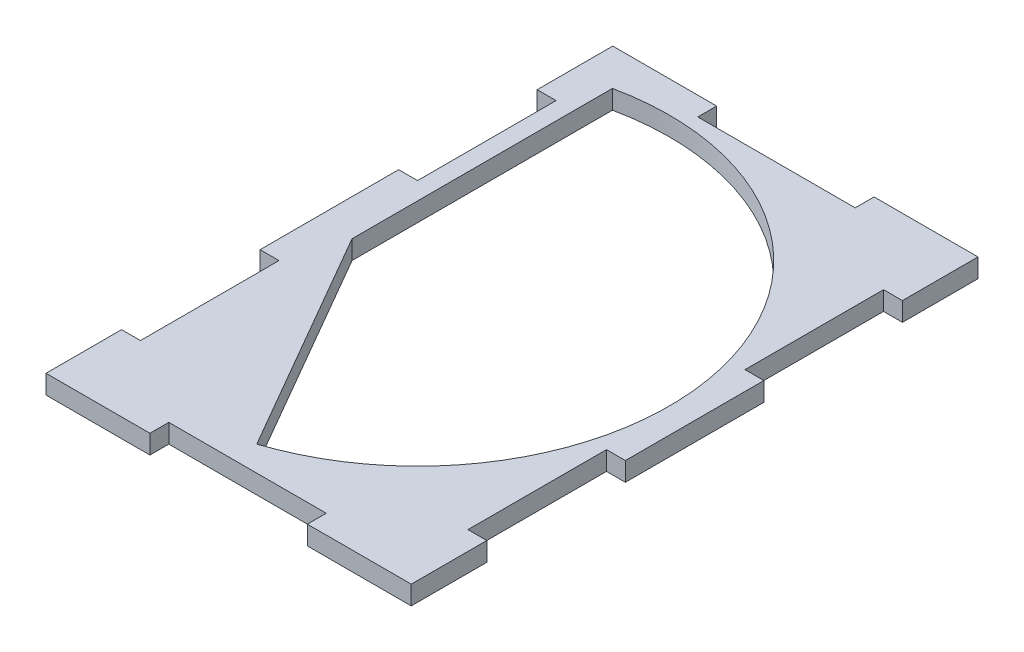
ISO-10303-21;
HEADER;
FILE_DESCRIPTION(('STEP AP214'),'2;1');
FILE_NAME('part.step','',(''),(''),'','','');
FILE_SCHEMA(('AUTOMOTIVE_DESIGN { 1 0 10303 214 1 1 1 1 }'));
ENDSEC;
DATA;
#1=APPLICATION_CONTEXT('core data for automotive mechanical design processes');
#2=APPLICATION_PROTOCOL_DEFINITION('international standard','automotive_design',2000,#1);
#3=PRODUCT_CONTEXT('',#1,'mechanical');
#4=PRODUCT('Part','Part','',(#3));
#5=PRODUCT_RELATED_PRODUCT_CATEGORY('part','',(#4));
#6=PRODUCT_DEFINITION_FORMATION('','',#4);
#7=PRODUCT_DEFINITION_CONTEXT('part definition',#1,'design');
#8=PRODUCT_DEFINITION('design','',#6,#7);
#9=PRODUCT_DEFINITION_SHAPE('','',#8);
#10=(LENGTH_UNIT() NAMED_UNIT(*) SI_UNIT(.MILLI.,.METRE.));
#11=(NAMED_UNIT(*) PLANE_ANGLE_UNIT() SI_UNIT($,.RADIAN.));
#12=(NAMED_UNIT(*) SI_UNIT($,.STERADIAN.) SOLID_ANGLE_UNIT());
#13=UNCERTAINTY_MEASURE_WITH_UNIT(LENGTH_MEASURE(1.E-05),#10,'distance_accuracy_value','');
#14=(GEOMETRIC_REPRESENTATION_CONTEXT(3) GLOBAL_UNCERTAINTY_ASSIGNED_CONTEXT((#13)) GLOBAL_UNIT_ASSIGNED_CONTEXT((#10,
#11,#12)) REPRESENTATION_CONTEXT('',''));
#15=CARTESIAN_POINT('',(0.,0.,0.));
#16=DIRECTION('',(0.,0.,1.));
#17=DIRECTION('',(1.,0.,0.));
#18=AXIS2_PLACEMENT_3D('',#15,#16,#17);
#19=CARTESIAN_POINT('',(0.,3.,0.));
#20=DIRECTION('',(0.,-1.,0.));
#21=DIRECTION('',(0.,0.,-1.));
#22=AXIS2_PLACEMENT_3D('',#19,#20,#21);
#23=PLANE('',#22);
#24=DIRECTION('',(1.,0.,0.));
#25=VECTOR('',#24,1.);
#26=CARTESIAN_POINT('',(-26.,3.,12.));
#27=LINE('',#26,#25);
#28=CARTESIAN_POINT('',(-26.,3.,12.));
#29=VERTEX_POINT('',#28);
#30=CARTESIAN_POINT('',(-23.,3.,12.));
#31=VERTEX_POINT('',#30);
#32=EDGE_CURVE('E263',#29,#31,#27,.T.);
#33=ORIENTED_EDGE('',*,*,#32,.T.);
#34=DIRECTION('',(0.,0.,1.));
#35=VECTOR('',#34,1.);
#36=CARTESIAN_POINT('',(-23.,3.,12.));
#37=LINE('',#36,#35);
#38=CARTESIAN_POINT('',(-23.,3.,34.));
#39=VERTEX_POINT('',#38);
#40=EDGE_CURVE('E266',#31,#39,#37,.T.);
#41=ORIENTED_EDGE('',*,*,#40,.T.);
#42=DIRECTION('',(-1.,0.,0.));
#43=VECTOR('',#42,1.);
#44=CARTESIAN_POINT('',(-23.,3.,34.));
#45=LINE('',#44,#43);
#46=CARTESIAN_POINT('',(-26.,3.,34.));
#47=VERTEX_POINT('',#46);
#48=EDGE_CURVE('E269',#39,#47,#45,.T.);
#49=ORIENTED_EDGE('',*,*,#48,.T.);
#50=DIRECTION('',(0.,0.,1.));
#51=VECTOR('',#50,1.);
#52=CARTESIAN_POINT('',(-26.,3.,34.));
#53=LINE('',#52,#51);
#54=CARTESIAN_POINT('',(-26.,3.,56.));
#55=VERTEX_POINT('',#54);
#56=EDGE_CURVE('E271',#47,#55,#53,.T.);
#57=ORIENTED_EDGE('',*,*,#56,.T.);
#58=DIRECTION('',(1.,0.,0.));
#59=VECTOR('',#58,1.);
#60=CARTESIAN_POINT('',(-26.,3.,56.));
#61=LINE('',#60,#59);
#62=CARTESIAN_POINT('',(-23.,3.,56.));
#63=VERTEX_POINT('',#62);
#64=EDGE_CURVE('E273',#55,#63,#61,.T.);
#65=ORIENTED_EDGE('',*,*,#64,.T.);
#66=DIRECTION('',(0.,0.,1.));
#67=VECTOR('',#66,1.);
#68=CARTESIAN_POINT('',(-23.,3.,56.));
#69=LINE('',#68,#67);
#70=CARTESIAN_POINT('',(-23.,3.,78.));
#71=VERTEX_POINT('',#70);
#72=EDGE_CURVE('E275',#63,#71,#69,.T.);
#73=ORIENTED_EDGE('',*,*,#72,.T.);
#74=DIRECTION('',(-1.,0.,0.));
#75=VECTOR('',#74,1.);
#76=CARTESIAN_POINT('',(-23.,3.,78.));
#77=LINE('',#76,#75);
#78=CARTESIAN_POINT('',(-26.,3.,78.));
#79=VERTEX_POINT('',#78);
#80=EDGE_CURVE('E277',#71,#79,#77,.T.);
#81=ORIENTED_EDGE('',*,*,#80,.T.);
#82=DIRECTION('',(0.,0.,1.));
#83=VECTOR('',#82,1.);
#84=CARTESIAN_POINT('',(-26.,3.,78.));
#85=LINE('',#84,#83);
#86=CARTESIAN_POINT('',(-26.,3.,90.));
#87=VERTEX_POINT('',#86);
#88=EDGE_CURVE('E279',#79,#87,#85,.T.);
#89=ORIENTED_EDGE('',*,*,#88,.T.);
#90=DIRECTION('',(1.,0.,0.));
#91=VECTOR('',#90,1.);
#92=CARTESIAN_POINT('',(-26.,3.,90.));
#93=LINE('',#92,#91);
#94=CARTESIAN_POINT('',(-9.49999999999999,3.,90.));
#95=VERTEX_POINT('',#94);
#96=EDGE_CURVE('E281',#87,#95,#93,.T.);
#97=ORIENTED_EDGE('',*,*,#96,.T.);
#98=DIRECTION('',(0.,0.,-1.));
#99=VECTOR('',#98,1.);
#100=CARTESIAN_POINT('',(-9.49999999999999,3.,90.));
#101=LINE('',#100,#99);
#102=CARTESIAN_POINT('',(-9.49999999999999,3.,87.));
#103=VERTEX_POINT('',#102);
#104=EDGE_CURVE('E283',#95,#103,#101,.T.);
#105=ORIENTED_EDGE('',*,*,#104,.T.);
#106=DIRECTION('',(1.,0.,0.));
#107=VECTOR('',#106,1.);
#108=CARTESIAN_POINT('',(-9.49999999999999,3.,87.));
#109=LINE('',#108,#107);
#110=CARTESIAN_POINT('',(15.5,3.,87.));
#111=VERTEX_POINT('',#110);
#112=EDGE_CURVE('E285',#103,#111,#109,.T.);
#113=ORIENTED_EDGE('',*,*,#112,.T.);
#114=DIRECTION('',(0.,0.,1.));
#115=VECTOR('',#114,1.);
#116=CARTESIAN_POINT('',(15.5,3.,87.));
#117=LINE('',#116,#115);
#118=CARTESIAN_POINT('',(15.5,3.,90.));
#119=VERTEX_POINT('',#118);
#120=EDGE_CURVE('E287',#111,#119,#117,.T.);
#121=ORIENTED_EDGE('',*,*,#120,.T.);
#122=DIRECTION('',(1.,0.,0.));
#123=VECTOR('',#122,1.);
#124=CARTESIAN_POINT('',(15.5,3.,90.));
#125=LINE('',#124,#123);
#126=CARTESIAN_POINT('',(32.,3.,90.));
#127=VERTEX_POINT('',#126);
#128=EDGE_CURVE('E289',#119,#127,#125,.T.);
#129=ORIENTED_EDGE('',*,*,#128,.T.);
#130=DIRECTION('',(0.,0.,-1.));
#131=VECTOR('',#130,1.);
#132=CARTESIAN_POINT('',(32.,3.,78.));
#133=LINE('',#132,#131);
#134=CARTESIAN_POINT('',(32.,3.,78.));
#135=VERTEX_POINT('',#134);
#136=EDGE_CURVE('E291',#127,#135,#133,.T.);
#137=ORIENTED_EDGE('',*,*,#136,.T.);
#138=DIRECTION('',(-1.,0.,0.));
#139=VECTOR('',#138,1.);
#140=CARTESIAN_POINT('',(32.,3.,78.));
#141=LINE('',#140,#139);
#142=CARTESIAN_POINT('',(29.,3.,78.));
#143=VERTEX_POINT('',#142);
#144=EDGE_CURVE('E293',#135,#143,#141,.T.);
#145=ORIENTED_EDGE('',*,*,#144,.T.);
#146=DIRECTION('',(0.,0.,-1.));
#147=VECTOR('',#146,1.);
#148=CARTESIAN_POINT('',(29.,3.,78.));
#149=LINE('',#148,#147);
#150=CARTESIAN_POINT('',(29.,3.,56.));
#151=VERTEX_POINT('',#150);
#152=EDGE_CURVE('E295',#143,#151,#149,.T.);
#153=ORIENTED_EDGE('',*,*,#152,.T.);
#154=DIRECTION('',(1.,0.,0.));
#155=VECTOR('',#154,1.);
#156=CARTESIAN_POINT('',(29.,3.,56.));
#157=LINE('',#156,#155);
#158=CARTESIAN_POINT('',(32.,3.,56.));
#159=VERTEX_POINT('',#158);
#160=EDGE_CURVE('E297',#151,#159,#157,.T.);
#161=ORIENTED_EDGE('',*,*,#160,.T.);
#162=DIRECTION('',(0.,0.,-1.));
#163=VECTOR('',#162,1.);
#164=CARTESIAN_POINT('',(32.,3.,34.));
#165=LINE('',#164,#163);
#166=CARTESIAN_POINT('',(32.,3.,34.));
#167=VERTEX_POINT('',#166);
#168=EDGE_CURVE('E299',#159,#167,#165,.T.);
#169=ORIENTED_EDGE('',*,*,#168,.T.);
#170=DIRECTION('',(-1.,0.,0.));
#171=VECTOR('',#170,1.);
#172=CARTESIAN_POINT('',(29.,3.,34.));
#173=LINE('',#172,#171);
#174=CARTESIAN_POINT('',(29.,3.,34.));
#175=VERTEX_POINT('',#174);
#176=EDGE_CURVE('E301',#167,#175,#173,.T.);
#177=ORIENTED_EDGE('',*,*,#176,.T.);
#178=DIRECTION('',(0.,0.,-1.));
#179=VECTOR('',#178,1.);
#180=CARTESIAN_POINT('',(29.,3.,12.));
#181=LINE('',#180,#179);
#182=CARTESIAN_POINT('',(29.,3.,12.));
#183=VERTEX_POINT('',#182);
#184=EDGE_CURVE('E303',#175,#183,#181,.T.);
#185=ORIENTED_EDGE('',*,*,#184,.T.);
#186=DIRECTION('',(1.,0.,0.));
#187=VECTOR('',#186,1.);
#188=CARTESIAN_POINT('',(32.,3.,12.));
#189=LINE('',#188,#187);
#190=CARTESIAN_POINT('',(32.,3.,12.));
#191=VERTEX_POINT('',#190);
#192=EDGE_CURVE('E305',#183,#191,#189,.T.);
#193=ORIENTED_EDGE('',*,*,#192,.T.);
#194=DIRECTION('',(0.,0.,-1.));
#195=VECTOR('',#194,1.);
#196=CARTESIAN_POINT('',(32.,3.,0.));
#197=LINE('',#196,#195);
#198=CARTESIAN_POINT('',(32.,3.,0.));
#199=VERTEX_POINT('',#198);
#200=EDGE_CURVE('E307',#191,#199,#197,.T.);
#201=ORIENTED_EDGE('',*,*,#200,.T.);
#202=DIRECTION('',(-1.,0.,0.));
#203=VECTOR('',#202,1.);
#204=CARTESIAN_POINT('',(15.5,3.,0.));
#205=LINE('',#204,#203);
#206=CARTESIAN_POINT('',(15.5,3.,0.));
#207=VERTEX_POINT('',#206);
#208=EDGE_CURVE('E309',#199,#207,#205,.T.);
#209=ORIENTED_EDGE('',*,*,#208,.T.);
#210=DIRECTION('',(0.,0.,1.));
#211=VECTOR('',#210,1.);
#212=CARTESIAN_POINT('',(15.5,3.,3.));
#213=LINE('',#212,#211);
#214=CARTESIAN_POINT('',(15.5,3.,3.));
#215=VERTEX_POINT('',#214);
#216=EDGE_CURVE('E311',#207,#215,#213,.T.);
#217=ORIENTED_EDGE('',*,*,#216,.T.);
#218=DIRECTION('',(-1.,0.,0.));
#219=VECTOR('',#218,1.);
#220=CARTESIAN_POINT('',(-9.5,3.,3.));
#221=LINE('',#220,#219);
#222=CARTESIAN_POINT('',(-9.5,3.,3.));
#223=VERTEX_POINT('',#222);
#224=EDGE_CURVE('E313',#215,#223,#221,.T.);
#225=ORIENTED_EDGE('',*,*,#224,.T.);
#226=DIRECTION('',(0.,0.,-1.));
#227=VECTOR('',#226,1.);
#228=CARTESIAN_POINT('',(-9.5,3.,0.));
#229=LINE('',#228,#227);
#230=CARTESIAN_POINT('',(-9.5,3.,0.));
#231=VERTEX_POINT('',#230);
#232=EDGE_CURVE('E315',#223,#231,#229,.T.);
#233=ORIENTED_EDGE('',*,*,#232,.T.);
#234=DIRECTION('',(-1.,0.,0.));
#235=VECTOR('',#234,1.);
#236=CARTESIAN_POINT('',(-26.,3.,0.));
#237=LINE('',#236,#235);
#238=CARTESIAN_POINT('',(-26.,3.,0.));
#239=VERTEX_POINT('',#238);
#240=EDGE_CURVE('E317',#231,#239,#237,.T.);
#241=ORIENTED_EDGE('',*,*,#240,.T.);
#242=DIRECTION('',(0.,0.,1.));
#243=VECTOR('',#242,1.);
#244=CARTESIAN_POINT('',(-26.,3.,0.));
#245=LINE('',#244,#243);
#246=EDGE_CURVE('E319',#239,#29,#245,.T.);
#247=ORIENTED_EDGE('',*,*,#246,.T.);
#248=EDGE_LOOP('',(#33,#41,#49,#57,#65,#73,#81,#89,#97,#105,#113,#121,#129,#137,#145,#153,#161,
#169,#177,#185,#193,#201,#209,#217,#225,#233,#241,#247));
#249=FACE_BOUND('',#248,.T.);
#250=CARTESIAN_POINT('',(-12.,3.,45.));
#251=DIRECTION('',(0.,1.,0.));
#252=DIRECTION('',(0.,0.,-1.));
#253=AXIS2_PLACEMENT_3D('',#250,#251,#252);
#254=CIRCLE('',#253,40.);
#255=CARTESIAN_POINT('',(0.473831151104231,3.,83.0053093187483));
#256=VERTEX_POINT('',#255);
#257=CARTESIAN_POINT('',(-20.2,3.,5.84952107572628));
#258=VERTEX_POINT('',#257);
#259=EDGE_CURVE('E236',#256,#258,#254,.T.);
#260=ORIENTED_EDGE('',*,*,#259,.F.);
#261=DIRECTION('',(0.499999999999995,0.,0.866025403784442));
#262=VECTOR('',#261,1.);
#263=CARTESIAN_POINT('',(-20.2,3.,47.1971833779352));
#264=LINE('',#263,#262);
#265=CARTESIAN_POINT('',(-20.2,3.,47.1971833779352));
#266=VERTEX_POINT('',#265);
#267=EDGE_CURVE('E253',#266,#256,#264,.T.);
#268=ORIENTED_EDGE('',*,*,#267,.F.);
#269=DIRECTION('',(0.,0.,1.));
#270=VECTOR('',#269,1.);
#271=CARTESIAN_POINT('',(-20.2,3.,47.1971833779352));
#272=LINE('',#271,#270);
#273=EDGE_CURVE('E244',#258,#266,#272,.T.);
#274=ORIENTED_EDGE('',*,*,#273,.F.);
#275=EDGE_LOOP('',(#260,#268,#274));
#276=FACE_BOUND('',#275,.T.);
#277=ADVANCED_FACE('F33',(#249,#276),#23,.F.);
#278=CARTESIAN_POINT('',(0.,0.,0.));
#279=DIRECTION('',(0.,-1.,0.));
#280=DIRECTION('',(0.,0.,-1.));
#281=AXIS2_PLACEMENT_3D('',#278,#279,#280);
#282=PLANE('',#281);
#283=DIRECTION('',(1.,0.,0.));
#284=VECTOR('',#283,1.);
#285=CARTESIAN_POINT('',(-26.,0.,12.));
#286=LINE('',#285,#284);
#287=CARTESIAN_POINT('',(-26.,0.,12.));
#288=VERTEX_POINT('',#287);
#289=CARTESIAN_POINT('',(-23.,0.,12.));
#290=VERTEX_POINT('',#289);
#291=EDGE_CURVE('E251',#288,#290,#286,.T.);
#292=ORIENTED_EDGE('',*,*,#291,.F.);
#293=DIRECTION('',(0.,0.,1.));
#294=VECTOR('',#293,1.);
#295=CARTESIAN_POINT('',(-26.,0.,0.));
#296=LINE('',#295,#294);
#297=CARTESIAN_POINT('',(-26.,0.,0.));
#298=VERTEX_POINT('',#297);
#299=EDGE_CURVE('E267',#298,#288,#296,.T.);
#300=ORIENTED_EDGE('',*,*,#299,.F.);
#301=DIRECTION('',(-1.,0.,0.));
#302=VECTOR('',#301,1.);
#303=CARTESIAN_POINT('',(-26.,0.,0.));
#304=LINE('',#303,#302);
#305=CARTESIAN_POINT('',(-9.5,0.,0.));
#306=VERTEX_POINT('',#305);
#307=EDGE_CURVE('E374',#306,#298,#304,.T.);
#308=ORIENTED_EDGE('',*,*,#307,.F.);
#309=DIRECTION('',(0.,0.,-1.));
#310=VECTOR('',#309,1.);
#311=CARTESIAN_POINT('',(-9.5,0.,0.));
#312=LINE('',#311,#310);
#313=CARTESIAN_POINT('',(-9.5,0.,3.));
#314=VERTEX_POINT('',#313);
#315=EDGE_CURVE('E372',#314,#306,#312,.T.);
#316=ORIENTED_EDGE('',*,*,#315,.F.);
#317=DIRECTION('',(-1.,0.,0.));
#318=VECTOR('',#317,1.);
#319=CARTESIAN_POINT('',(-9.5,0.,3.));
#320=LINE('',#319,#318);
#321=CARTESIAN_POINT('',(15.5,0.,3.));
#322=VERTEX_POINT('',#321);
#323=EDGE_CURVE('E370',#322,#314,#320,.T.);
#324=ORIENTED_EDGE('',*,*,#323,.F.);
#325=DIRECTION('',(0.,0.,1.));
#326=VECTOR('',#325,1.);
#327=CARTESIAN_POINT('',(15.5,0.,3.));
#328=LINE('',#327,#326);
#329=CARTESIAN_POINT('',(15.5,0.,0.));
#330=VERTEX_POINT('',#329);
#331=EDGE_CURVE('E368',#330,#322,#328,.T.);
#332=ORIENTED_EDGE('',*,*,#331,.F.);
#333=DIRECTION('',(-1.,0.,0.));
#334=VECTOR('',#333,1.);
#335=CARTESIAN_POINT('',(15.5,0.,0.));
#336=LINE('',#335,#334);
#337=CARTESIAN_POINT('',(32.,0.,0.));
#338=VERTEX_POINT('',#337);
#339=EDGE_CURVE('E366',#338,#330,#336,.T.);
#340=ORIENTED_EDGE('',*,*,#339,.F.);
#341=DIRECTION('',(0.,0.,-1.));
#342=VECTOR('',#341,1.);
#343=CARTESIAN_POINT('',(32.,0.,0.));
#344=LINE('',#343,#342);
#345=CARTESIAN_POINT('',(32.,0.,12.));
#346=VERTEX_POINT('',#345);
#347=EDGE_CURVE('E364',#346,#338,#344,.T.);
#348=ORIENTED_EDGE('',*,*,#347,.F.);
#349=DIRECTION('',(1.,0.,0.));
#350=VECTOR('',#349,1.);
#351=CARTESIAN_POINT('',(32.,0.,12.));
#352=LINE('',#351,#350);
#353=CARTESIAN_POINT('',(29.,0.,12.));
#354=VERTEX_POINT('',#353);
#355=EDGE_CURVE('E362',#354,#346,#352,.T.);
#356=ORIENTED_EDGE('',*,*,#355,.F.);
#357=DIRECTION('',(0.,0.,-1.));
#358=VECTOR('',#357,1.);
#359=CARTESIAN_POINT('',(29.,0.,12.));
#360=LINE('',#359,#358);
#361=CARTESIAN_POINT('',(29.,0.,34.));
#362=VERTEX_POINT('',#361);
#363=EDGE_CURVE('E360',#362,#354,#360,.T.);
#364=ORIENTED_EDGE('',*,*,#363,.F.);
#365=DIRECTION('',(-1.,0.,0.));
#366=VECTOR('',#365,1.);
#367=CARTESIAN_POINT('',(29.,0.,34.));
#368=LINE('',#367,#366);
#369=CARTESIAN_POINT('',(32.,0.,34.));
#370=VERTEX_POINT('',#369);
#371=EDGE_CURVE('E358',#370,#362,#368,.T.);
#372=ORIENTED_EDGE('',*,*,#371,.F.);
#373=DIRECTION('',(0.,0.,-1.));
#374=VECTOR('',#373,1.);
#375=CARTESIAN_POINT('',(32.,0.,34.));
#376=LINE('',#375,#374);
#377=CARTESIAN_POINT('',(32.,0.,56.));
#378=VERTEX_POINT('',#377);
#379=EDGE_CURVE('E356',#378,#370,#376,.T.);
#380=ORIENTED_EDGE('',*,*,#379,.F.);
#381=DIRECTION('',(1.,0.,0.));
#382=VECTOR('',#381,1.);
#383=CARTESIAN_POINT('',(29.,0.,56.));
#384=LINE('',#383,#382);
#385=CARTESIAN_POINT('',(29.,0.,56.));
#386=VERTEX_POINT('',#385);
#387=EDGE_CURVE('E354',#386,#378,#384,.T.);
#388=ORIENTED_EDGE('',*,*,#387,.F.);
#389=DIRECTION('',(0.,0.,-1.));
#390=VECTOR('',#389,1.);
#391=CARTESIAN_POINT('',(29.,0.,78.));
#392=LINE('',#391,#390);
#393=CARTESIAN_POINT('',(29.,0.,78.));
#394=VERTEX_POINT('',#393);
#395=EDGE_CURVE('E352',#394,#386,#392,.T.);
#396=ORIENTED_EDGE('',*,*,#395,.F.);
#397=DIRECTION('',(-1.,0.,0.));
#398=VECTOR('',#397,1.);
#399=CARTESIAN_POINT('',(32.,0.,78.));
#400=LINE('',#399,#398);
#401=CARTESIAN_POINT('',(32.,0.,78.));
#402=VERTEX_POINT('',#401);
#403=EDGE_CURVE('E350',#402,#394,#400,.T.);
#404=ORIENTED_EDGE('',*,*,#403,.F.);
#405=DIRECTION('',(0.,0.,-1.));
#406=VECTOR('',#405,1.);
#407=CARTESIAN_POINT('',(32.,0.,78.));
#408=LINE('',#407,#406);
#409=CARTESIAN_POINT('',(32.,0.,90.));
#410=VERTEX_POINT('',#409);
#411=EDGE_CURVE('E348',#410,#402,#408,.T.);
#412=ORIENTED_EDGE('',*,*,#411,.F.);
#413=DIRECTION('',(1.,0.,0.));
#414=VECTOR('',#413,1.);
#415=CARTESIAN_POINT('',(15.5,0.,90.));
#416=LINE('',#415,#414);
#417=CARTESIAN_POINT('',(15.5,0.,90.));
#418=VERTEX_POINT('',#417);
#419=EDGE_CURVE('E346',#418,#410,#416,.T.);
#420=ORIENTED_EDGE('',*,*,#419,.F.);
#421=DIRECTION('',(0.,0.,1.));
#422=VECTOR('',#421,1.);
#423=CARTESIAN_POINT('',(15.5,0.,87.));
#424=LINE('',#423,#422);
#425=CARTESIAN_POINT('',(15.5,0.,87.));
#426=VERTEX_POINT('',#425);
#427=EDGE_CURVE('E344',#426,#418,#424,.T.);
#428=ORIENTED_EDGE('',*,*,#427,.F.);
#429=DIRECTION('',(1.,0.,0.));
#430=VECTOR('',#429,1.);
#431=CARTESIAN_POINT('',(-9.49999999999999,0.,87.));
#432=LINE('',#431,#430);
#433=CARTESIAN_POINT('',(-9.49999999999999,0.,87.));
#434=VERTEX_POINT('',#433);
#435=EDGE_CURVE('E342',#434,#426,#432,.T.);
#436=ORIENTED_EDGE('',*,*,#435,.F.);
#437=DIRECTION('',(0.,0.,-1.));
#438=VECTOR('',#437,1.);
#439=CARTESIAN_POINT('',(-9.49999999999999,0.,90.));
#440=LINE('',#439,#438);
#441=CARTESIAN_POINT('',(-9.49999999999999,0.,90.));
#442=VERTEX_POINT('',#441);
#443=EDGE_CURVE('E340',#442,#434,#440,.T.);
#444=ORIENTED_EDGE('',*,*,#443,.F.);
#445=DIRECTION('',(1.,0.,0.));
#446=VECTOR('',#445,1.);
#447=CARTESIAN_POINT('',(-26.,0.,90.));
#448=LINE('',#447,#446);
#449=CARTESIAN_POINT('',(-26.,0.,90.));
#450=VERTEX_POINT('',#449);
#451=EDGE_CURVE('E338',#450,#442,#448,.T.);
#452=ORIENTED_EDGE('',*,*,#451,.F.);
#453=DIRECTION('',(0.,0.,1.));
#454=VECTOR('',#453,1.);
#455=CARTESIAN_POINT('',(-26.,0.,78.));
#456=LINE('',#455,#454);
#457=CARTESIAN_POINT('',(-26.,0.,78.));
#458=VERTEX_POINT('',#457);
#459=EDGE_CURVE('E336',#458,#450,#456,.T.);
#460=ORIENTED_EDGE('',*,*,#459,.F.);
#461=DIRECTION('',(-1.,0.,0.));
#462=VECTOR('',#461,1.);
#463=CARTESIAN_POINT('',(-23.,0.,78.));
#464=LINE('',#463,#462);
#465=CARTESIAN_POINT('',(-23.,0.,78.));
#466=VERTEX_POINT('',#465);
#467=EDGE_CURVE('E334',#466,#458,#464,.T.);
#468=ORIENTED_EDGE('',*,*,#467,.F.);
#469=DIRECTION('',(0.,0.,1.));
#470=VECTOR('',#469,1.);
#471=CARTESIAN_POINT('',(-23.,0.,56.));
#472=LINE('',#471,#470);
#473=CARTESIAN_POINT('',(-23.,0.,56.));
#474=VERTEX_POINT('',#473);
#475=EDGE_CURVE('E332',#474,#466,#472,.T.);
#476=ORIENTED_EDGE('',*,*,#475,.F.);
#477=DIRECTION('',(1.,0.,0.));
#478=VECTOR('',#477,1.);
#479=CARTESIAN_POINT('',(-26.,0.,56.));
#480=LINE('',#479,#478);
#481=CARTESIAN_POINT('',(-26.,0.,56.));
#482=VERTEX_POINT('',#481);
#483=EDGE_CURVE('E330',#482,#474,#480,.T.);
#484=ORIENTED_EDGE('',*,*,#483,.F.);
#485=DIRECTION('',(0.,0.,1.));
#486=VECTOR('',#485,1.);
#487=CARTESIAN_POINT('',(-26.,0.,34.));
#488=LINE('',#487,#486);
#489=CARTESIAN_POINT('',(-26.,0.,34.));
#490=VERTEX_POINT('',#489);
#491=EDGE_CURVE('E328',#490,#482,#488,.T.);
#492=ORIENTED_EDGE('',*,*,#491,.F.);
#493=DIRECTION('',(-1.,0.,0.));
#494=VECTOR('',#493,1.);
#495=CARTESIAN_POINT('',(-23.,0.,34.));
#496=LINE('',#495,#494);
#497=CARTESIAN_POINT('',(-23.,0.,34.));
#498=VERTEX_POINT('',#497);
#499=EDGE_CURVE('E326',#498,#490,#496,.T.);
#500=ORIENTED_EDGE('',*,*,#499,.F.);
#501=DIRECTION('',(0.,0.,1.));
#502=VECTOR('',#501,1.);
#503=CARTESIAN_POINT('',(-23.,0.,12.));
#504=LINE('',#503,#502);
#505=EDGE_CURVE('E324',#290,#498,#504,.T.);
#506=ORIENTED_EDGE('',*,*,#505,.F.);
#507=EDGE_LOOP('',(#292,#300,#308,#316,#324,#332,#340,#348,#356,#364,#372,#380,#388,#396,#404,
#412,#420,#428,#436,#444,#452,#460,#468,#476,#484,#492,#500,#506));
#508=FACE_BOUND('',#507,.T.);
#509=DIRECTION('',(0.499999999999995,0.,0.866025403784442));
#510=VECTOR('',#509,1.);
#511=CARTESIAN_POINT('',(-20.2,0.,47.1971833779352));
#512=LINE('',#511,#510);
#513=CARTESIAN_POINT('',(-20.2,0.,47.1971833779352));
#514=VERTEX_POINT('',#513);
#515=CARTESIAN_POINT('',(0.473831151104234,0.,83.0053093187483));
#516=VERTEX_POINT('',#515);
#517=EDGE_CURVE('E245',#514,#516,#512,.T.);
#518=ORIENTED_EDGE('',*,*,#517,.T.);
#519=CARTESIAN_POINT('',(-12.,0.,45.));
#520=DIRECTION('',(0.,1.,0.));
#521=DIRECTION('',(0.,0.,-1.));
#522=AXIS2_PLACEMENT_3D('',#519,#520,#521);
#523=CIRCLE('',#522,40.);
#524=CARTESIAN_POINT('',(-20.2,0.,5.84952107572628));
#525=VERTEX_POINT('',#524);
#526=EDGE_CURVE('E56',#516,#525,#523,.T.);
#527=ORIENTED_EDGE('',*,*,#526,.T.);
#528=DIRECTION('',(0.,0.,1.));
#529=VECTOR('',#528,1.);
#530=CARTESIAN_POINT('',(-20.2,0.,47.1971833779352));
#531=LINE('',#530,#529);
#532=EDGE_CURVE('E250',#525,#514,#531,.T.);
#533=ORIENTED_EDGE('',*,*,#532,.T.);
#534=EDGE_LOOP('',(#518,#527,#533));
#535=FACE_BOUND('',#534,.T.);
#536=ADVANCED_FACE('F464',(#508,#535),#282,.T.);
#537=CARTESIAN_POINT('',(-26.,3.,12.));
#538=DIRECTION('',(0.,0.,-1.));
#539=DIRECTION('',(-1.,0.,0.));
#540=AXIS2_PLACEMENT_3D('',#537,#538,#539);
#541=PLANE('',#540);
#542=ORIENTED_EDGE('',*,*,#291,.T.);
#543=DIRECTION('',(0.,-1.,0.));
#544=VECTOR('',#543,1.);
#545=CARTESIAN_POINT('',(-23.,3.,12.));
#546=LINE('',#545,#544);
#547=EDGE_CURVE('E11',#31,#290,#546,.T.);
#548=ORIENTED_EDGE('',*,*,#547,.F.);
#549=ORIENTED_EDGE('',*,*,#32,.F.);
#550=DIRECTION('',(0.,-1.,0.));
#551=VECTOR('',#550,1.);
#552=CARTESIAN_POINT('',(-26.,3.,12.));
#553=LINE('',#552,#551);
#554=EDGE_CURVE('E321',#29,#288,#553,.T.);
#555=ORIENTED_EDGE('',*,*,#554,.T.);
#556=EDGE_LOOP('',(#542,#548,#549,#555));
#557=FACE_BOUND('',#556,.T.);
#558=ADVANCED_FACE('F35',(#557),#541,.F.);
#559=CARTESIAN_POINT('',(-23.,3.,12.));
#560=DIRECTION('',(1.,0.,0.));
#561=DIRECTION('',(0.,0.,-1.));
#562=AXIS2_PLACEMENT_3D('',#559,#560,#561);
#563=PLANE('',#562);
#564=ORIENTED_EDGE('',*,*,#505,.T.);
#565=DIRECTION('',(0.,-1.,0.));
#566=VECTOR('',#565,1.);
#567=CARTESIAN_POINT('',(-23.,3.,34.));
#568=LINE('',#567,#566);
#569=EDGE_CURVE('E41',#39,#498,#568,.T.);
#570=ORIENTED_EDGE('',*,*,#569,.F.);
#571=ORIENTED_EDGE('',*,*,#40,.F.);
#572=ORIENTED_EDGE('',*,*,#547,.T.);
#573=EDGE_LOOP('',(#564,#570,#571,#572));
#574=FACE_BOUND('',#573,.T.);
#575=ADVANCED_FACE('F481',(#574),#563,.F.);
#576=CARTESIAN_POINT('',(-23.,3.,34.));
#577=DIRECTION('',(0.,0.,1.));
#578=DIRECTION('',(1.,0.,0.));
#579=AXIS2_PLACEMENT_3D('',#576,#577,#578);
#580=PLANE('',#579);
#581=ORIENTED_EDGE('',*,*,#499,.T.);
#582=DIRECTION('',(0.,-1.,0.));
#583=VECTOR('',#582,1.);
#584=CARTESIAN_POINT('',(-26.,3.,34.));
#585=LINE('',#584,#583);
#586=EDGE_CURVE('E451',#47,#490,#585,.T.);
#587=ORIENTED_EDGE('',*,*,#586,.F.);
#588=ORIENTED_EDGE('',*,*,#48,.F.);
#589=ORIENTED_EDGE('',*,*,#569,.T.);
#590=EDGE_LOOP('',(#581,#587,#588,#589));
#591=FACE_BOUND('',#590,.T.);
#592=ADVANCED_FACE('F458',(#591),#580,.F.);
#593=CARTESIAN_POINT('',(-26.,3.,34.));
#594=DIRECTION('',(1.,0.,0.));
#595=DIRECTION('',(0.,0.,-1.));
#596=AXIS2_PLACEMENT_3D('',#593,#594,#595);
#597=PLANE('',#596);
#598=ORIENTED_EDGE('',*,*,#491,.T.);
#599=DIRECTION('',(0.,-1.,0.));
#600=VECTOR('',#599,1.);
#601=CARTESIAN_POINT('',(-26.,3.,56.));
#602=LINE('',#601,#600);
#603=EDGE_CURVE('E448',#55,#482,#602,.T.);
#604=ORIENTED_EDGE('',*,*,#603,.F.);
#605=ORIENTED_EDGE('',*,*,#56,.F.);
#606=ORIENTED_EDGE('',*,*,#586,.T.);
#607=EDGE_LOOP('',(#598,#604,#605,#606));
#608=FACE_BOUND('',#607,.T.);
#609=ADVANCED_FACE('F470',(#608),#597,.F.);
#610=CARTESIAN_POINT('',(-26.,3.,56.));
#611=DIRECTION('',(0.,0.,-1.));
#612=DIRECTION('',(-1.,0.,0.));
#613=AXIS2_PLACEMENT_3D('',#610,#611,#612);
#614=PLANE('',#613);
#615=ORIENTED_EDGE('',*,*,#483,.T.);
#616=DIRECTION('',(0.,-1.,0.));
#617=VECTOR('',#616,1.);
#618=CARTESIAN_POINT('',(-23.,3.,56.));
#619=LINE('',#618,#617);
#620=EDGE_CURVE('E445',#63,#474,#619,.T.);
#621=ORIENTED_EDGE('',*,*,#620,.F.);
#622=ORIENTED_EDGE('',*,*,#64,.F.);
#623=ORIENTED_EDGE('',*,*,#603,.T.);
#624=EDGE_LOOP('',(#615,#621,#622,#623));
#625=FACE_BOUND('',#624,.T.);
#626=ADVANCED_FACE('F474',(#625),#614,.F.);
#627=CARTESIAN_POINT('',(-23.,3.,56.));
#628=DIRECTION('',(1.,0.,0.));
#629=DIRECTION('',(0.,0.,-1.));
#630=AXIS2_PLACEMENT_3D('',#627,#628,#629);
#631=PLANE('',#630);
#632=ORIENTED_EDGE('',*,*,#475,.T.);
#633=DIRECTION('',(0.,-1.,0.));
#634=VECTOR('',#633,1.);
#635=CARTESIAN_POINT('',(-23.,3.,78.));
#636=LINE('',#635,#634);
#637=EDGE_CURVE('E442',#71,#466,#636,.T.);
#638=ORIENTED_EDGE('',*,*,#637,.F.);
#639=ORIENTED_EDGE('',*,*,#72,.F.);
#640=ORIENTED_EDGE('',*,*,#620,.T.);
#641=EDGE_LOOP('',(#632,#638,#639,#640));
#642=FACE_BOUND('',#641,.T.);
#643=ADVANCED_FACE('F594',(#642),#631,.F.);
#644=CARTESIAN_POINT('',(-23.,3.,78.));
#645=DIRECTION('',(0.,0.,1.));
#646=DIRECTION('',(1.,0.,0.));
#647=AXIS2_PLACEMENT_3D('',#644,#645,#646);
#648=PLANE('',#647);
#649=ORIENTED_EDGE('',*,*,#467,.T.);
#650=DIRECTION('',(0.,-1.,0.));
#651=VECTOR('',#650,1.);
#652=CARTESIAN_POINT('',(-26.,3.,78.));
#653=LINE('',#652,#651);
#654=EDGE_CURVE('E439',#79,#458,#653,.T.);
#655=ORIENTED_EDGE('',*,*,#654,.F.);
#656=ORIENTED_EDGE('',*,*,#80,.F.);
#657=ORIENTED_EDGE('',*,*,#637,.T.);
#658=EDGE_LOOP('',(#649,#655,#656,#657));
#659=FACE_BOUND('',#658,.T.);
#660=ADVANCED_FACE('F591',(#659),#648,.F.);
#661=CARTESIAN_POINT('',(-26.,3.,78.));
#662=DIRECTION('',(1.,0.,0.));
#663=DIRECTION('',(0.,0.,-1.));
#664=AXIS2_PLACEMENT_3D('',#661,#662,#663);
#665=PLANE('',#664);
#666=ORIENTED_EDGE('',*,*,#459,.T.);
#667=DIRECTION('',(0.,-1.,0.));
#668=VECTOR('',#667,1.);
#669=CARTESIAN_POINT('',(-26.,3.,90.));
#670=LINE('',#669,#668);
#671=EDGE_CURVE('E436',#87,#450,#670,.T.);
#672=ORIENTED_EDGE('',*,*,#671,.F.);
#673=ORIENTED_EDGE('',*,*,#88,.F.);
#674=ORIENTED_EDGE('',*,*,#654,.T.);
#675=EDGE_LOOP('',(#666,#672,#673,#674));
#676=FACE_BOUND('',#675,.T.);
#677=ADVANCED_FACE('F587',(#676),#665,.F.);
#678=CARTESIAN_POINT('',(-26.,3.,90.));
#679=DIRECTION('',(0.,0.,-1.));
#680=DIRECTION('',(-1.,0.,0.));
#681=AXIS2_PLACEMENT_3D('',#678,#679,#680);
#682=PLANE('',#681);
#683=ORIENTED_EDGE('',*,*,#451,.T.);
#684=DIRECTION('',(0.,-1.,0.));
#685=VECTOR('',#684,1.);
#686=CARTESIAN_POINT('',(-9.49999999999999,3.,90.));
#687=LINE('',#686,#685);
#688=EDGE_CURVE('E433',#95,#442,#687,.T.);
#689=ORIENTED_EDGE('',*,*,#688,.F.);
#690=ORIENTED_EDGE('',*,*,#96,.F.);
#691=ORIENTED_EDGE('',*,*,#671,.T.);
#692=EDGE_LOOP('',(#683,#689,#690,#691));
#693=FACE_BOUND('',#692,.T.);
#694=ADVANCED_FACE('F583',(#693),#682,.F.);
#695=CARTESIAN_POINT('',(-9.49999999999999,3.,90.));
#696=DIRECTION('',(-1.,0.,0.));
#697=DIRECTION('',(0.,0.,1.));
#698=AXIS2_PLACEMENT_3D('',#695,#696,#697);
#699=PLANE('',#698);
#700=ORIENTED_EDGE('',*,*,#443,.T.);
#701=DIRECTION('',(0.,-1.,0.));
#702=VECTOR('',#701,1.);
#703=CARTESIAN_POINT('',(-9.49999999999999,3.,87.));
#704=LINE('',#703,#702);
#705=EDGE_CURVE('E430',#103,#434,#704,.T.);
#706=ORIENTED_EDGE('',*,*,#705,.F.);
#707=ORIENTED_EDGE('',*,*,#104,.F.);
#708=ORIENTED_EDGE('',*,*,#688,.T.);
#709=EDGE_LOOP('',(#700,#706,#707,#708));
#710=FACE_BOUND('',#709,.T.);
#711=ADVANCED_FACE('F578',(#710),#699,.F.);
#712=CARTESIAN_POINT('',(-9.49999999999999,3.,87.));
#713=DIRECTION('',(0.,0.,-1.));
#714=DIRECTION('',(-1.,0.,0.));
#715=AXIS2_PLACEMENT_3D('',#712,#713,#714);
#716=PLANE('',#715);
#717=ORIENTED_EDGE('',*,*,#435,.T.);
#718=DIRECTION('',(0.,-1.,0.));
#719=VECTOR('',#718,1.);
#720=CARTESIAN_POINT('',(15.5,3.,87.));
#721=LINE('',#720,#719);
#722=EDGE_CURVE('E427',#111,#426,#721,.T.);
#723=ORIENTED_EDGE('',*,*,#722,.F.);
#724=ORIENTED_EDGE('',*,*,#112,.F.);
#725=ORIENTED_EDGE('',*,*,#705,.T.);
#726=EDGE_LOOP('',(#717,#723,#724,#725));
#727=FACE_BOUND('',#726,.T.);
#728=ADVANCED_FACE('F572',(#727),#716,.F.);
#729=CARTESIAN_POINT('',(15.5,3.,87.));
#730=DIRECTION('',(1.,0.,0.));
#731=DIRECTION('',(0.,0.,-1.));
#732=AXIS2_PLACEMENT_3D('',#729,#730,#731);
#733=PLANE('',#732);
#734=ORIENTED_EDGE('',*,*,#427,.T.);
#735=DIRECTION('',(0.,-1.,0.));
#736=VECTOR('',#735,1.);
#737=CARTESIAN_POINT('',(15.5,3.,90.));
#738=LINE('',#737,#736);
#739=EDGE_CURVE('E424',#119,#418,#738,.T.);
#740=ORIENTED_EDGE('',*,*,#739,.F.);
#741=ORIENTED_EDGE('',*,*,#120,.F.);
#742=ORIENTED_EDGE('',*,*,#722,.T.);
#743=EDGE_LOOP('',(#734,#740,#741,#742));
#744=FACE_BOUND('',#743,.T.);
#745=ADVANCED_FACE('F568',(#744),#733,.F.);
#746=CARTESIAN_POINT('',(15.5,3.,90.));
#747=DIRECTION('',(0.,0.,-1.));
#748=DIRECTION('',(-1.,0.,0.));
#749=AXIS2_PLACEMENT_3D('',#746,#747,#748);
#750=PLANE('',#749);
#751=ORIENTED_EDGE('',*,*,#419,.T.);
#752=DIRECTION('',(0.,-1.,0.));
#753=VECTOR('',#752,1.);
#754=CARTESIAN_POINT('',(32.,3.,90.));
#755=LINE('',#754,#753);
#756=EDGE_CURVE('E421',#127,#410,#755,.T.);
#757=ORIENTED_EDGE('',*,*,#756,.F.);
#758=ORIENTED_EDGE('',*,*,#128,.F.);
#759=ORIENTED_EDGE('',*,*,#739,.T.);
#760=EDGE_LOOP('',(#751,#757,#758,#759));
#761=FACE_BOUND('',#760,.T.);
#762=ADVANCED_FACE('F563',(#761),#750,.F.);
#763=CARTESIAN_POINT('',(32.,3.,78.));
#764=DIRECTION('',(-1.,0.,0.));
#765=DIRECTION('',(0.,0.,1.));
#766=AXIS2_PLACEMENT_3D('',#763,#764,#765);
#767=PLANE('',#766);
#768=ORIENTED_EDGE('',*,*,#411,.T.);
#769=DIRECTION('',(0.,-1.,0.));
#770=VECTOR('',#769,1.);
#771=CARTESIAN_POINT('',(32.,3.,78.));
#772=LINE('',#771,#770);
#773=EDGE_CURVE('E418',#135,#402,#772,.T.);
#774=ORIENTED_EDGE('',*,*,#773,.F.);
#775=ORIENTED_EDGE('',*,*,#136,.F.);
#776=ORIENTED_EDGE('',*,*,#756,.T.);
#777=EDGE_LOOP('',(#768,#774,#775,#776));
#778=FACE_BOUND('',#777,.T.);
#779=ADVANCED_FACE('F557',(#778),#767,.F.);
#780=CARTESIAN_POINT('',(32.,3.,78.));
#781=DIRECTION('',(0.,0.,1.));
#782=DIRECTION('',(1.,0.,0.));
#783=AXIS2_PLACEMENT_3D('',#780,#781,#782);
#784=PLANE('',#783);
#785=ORIENTED_EDGE('',*,*,#403,.T.);
#786=DIRECTION('',(0.,-1.,0.));
#787=VECTOR('',#786,1.);
#788=CARTESIAN_POINT('',(29.,3.,78.));
#789=LINE('',#788,#787);
#790=EDGE_CURVE('E415',#143,#394,#789,.T.);
#791=ORIENTED_EDGE('',*,*,#790,.F.);
#792=ORIENTED_EDGE('',*,*,#144,.F.);
#793=ORIENTED_EDGE('',*,*,#773,.T.);
#794=EDGE_LOOP('',(#785,#791,#792,#793));
#795=FACE_BOUND('',#794,.T.);
#796=ADVANCED_FACE('F553',(#795),#784,.F.);
#797=CARTESIAN_POINT('',(29.,3.,78.));
#798=DIRECTION('',(-1.,0.,0.));
#799=DIRECTION('',(0.,0.,1.));
#800=AXIS2_PLACEMENT_3D('',#797,#798,#799);
#801=PLANE('',#800);
#802=ORIENTED_EDGE('',*,*,#395,.T.);
#803=DIRECTION('',(0.,-1.,0.));
#804=VECTOR('',#803,1.);
#805=CARTESIAN_POINT('',(29.,3.,56.));
#806=LINE('',#805,#804);
#807=EDGE_CURVE('E412',#151,#386,#806,.T.);
#808=ORIENTED_EDGE('',*,*,#807,.F.);
#809=ORIENTED_EDGE('',*,*,#152,.F.);
#810=ORIENTED_EDGE('',*,*,#790,.T.);
#811=EDGE_LOOP('',(#802,#808,#809,#810));
#812=FACE_BOUND('',#811,.T.);
#813=ADVANCED_FACE('F548',(#812),#801,.F.);
#814=CARTESIAN_POINT('',(29.,3.,56.));
#815=DIRECTION('',(0.,0.,-1.));
#816=DIRECTION('',(-1.,0.,0.));
#817=AXIS2_PLACEMENT_3D('',#814,#815,#816);
#818=PLANE('',#817);
#819=ORIENTED_EDGE('',*,*,#387,.T.);
#820=DIRECTION('',(0.,-1.,0.));
#821=VECTOR('',#820,1.);
#822=CARTESIAN_POINT('',(32.,3.,56.));
#823=LINE('',#822,#821);
#824=EDGE_CURVE('E409',#159,#378,#823,.T.);
#825=ORIENTED_EDGE('',*,*,#824,.F.);
#826=ORIENTED_EDGE('',*,*,#160,.F.);
#827=ORIENTED_EDGE('',*,*,#807,.T.);
#828=EDGE_LOOP('',(#819,#825,#826,#827));
#829=FACE_BOUND('',#828,.T.);
#830=ADVANCED_FACE('F542',(#829),#818,.F.);
#831=CARTESIAN_POINT('',(32.,3.,34.));
#832=DIRECTION('',(-1.,0.,0.));
#833=DIRECTION('',(0.,0.,1.));
#834=AXIS2_PLACEMENT_3D('',#831,#832,#833);
#835=PLANE('',#834);
#836=ORIENTED_EDGE('',*,*,#379,.T.);
#837=DIRECTION('',(0.,-1.,0.));
#838=VECTOR('',#837,1.);
#839=CARTESIAN_POINT('',(32.,3.,34.));
#840=LINE('',#839,#838);
#841=EDGE_CURVE('E406',#167,#370,#840,.T.);
#842=ORIENTED_EDGE('',*,*,#841,.F.);
#843=ORIENTED_EDGE('',*,*,#168,.F.);
#844=ORIENTED_EDGE('',*,*,#824,.T.);
#845=EDGE_LOOP('',(#836,#842,#843,#844));
#846=FACE_BOUND('',#845,.T.);
#847=ADVANCED_FACE('F538',(#846),#835,.F.);
#848=CARTESIAN_POINT('',(29.,3.,34.));
#849=DIRECTION('',(0.,0.,1.));
#850=DIRECTION('',(1.,0.,0.));
#851=AXIS2_PLACEMENT_3D('',#848,#849,#850);
#852=PLANE('',#851);
#853=ORIENTED_EDGE('',*,*,#371,.T.);
#854=DIRECTION('',(0.,-1.,0.));
#855=VECTOR('',#854,1.);
#856=CARTESIAN_POINT('',(29.,3.,34.));
#857=LINE('',#856,#855);
#858=EDGE_CURVE('E403',#175,#362,#857,.T.);
#859=ORIENTED_EDGE('',*,*,#858,.F.);
#860=ORIENTED_EDGE('',*,*,#176,.F.);
#861=ORIENTED_EDGE('',*,*,#841,.T.);
#862=EDGE_LOOP('',(#853,#859,#860,#861));
#863=FACE_BOUND('',#862,.T.);
#864=ADVANCED_FACE('F533',(#863),#852,.F.);
#865=CARTESIAN_POINT('',(29.,3.,12.));
#866=DIRECTION('',(-1.,0.,0.));
#867=DIRECTION('',(0.,0.,1.));
#868=AXIS2_PLACEMENT_3D('',#865,#866,#867);
#869=PLANE('',#868);
#870=ORIENTED_EDGE('',*,*,#363,.T.);
#871=DIRECTION('',(0.,-1.,0.));
#872=VECTOR('',#871,1.);
#873=CARTESIAN_POINT('',(29.,3.,12.));
#874=LINE('',#873,#872);
#875=EDGE_CURVE('E400',#183,#354,#874,.T.);
#876=ORIENTED_EDGE('',*,*,#875,.F.);
#877=ORIENTED_EDGE('',*,*,#184,.F.);
#878=ORIENTED_EDGE('',*,*,#858,.T.);
#879=EDGE_LOOP('',(#870,#876,#877,#878));
#880=FACE_BOUND('',#879,.T.);
#881=ADVANCED_FACE('F527',(#880),#869,.F.);
#882=CARTESIAN_POINT('',(32.,3.,12.));
#883=DIRECTION('',(0.,0.,-1.));
#884=DIRECTION('',(-1.,0.,0.));
#885=AXIS2_PLACEMENT_3D('',#882,#883,#884);
#886=PLANE('',#885);
#887=ORIENTED_EDGE('',*,*,#355,.T.);
#888=DIRECTION('',(0.,-1.,0.));
#889=VECTOR('',#888,1.);
#890=CARTESIAN_POINT('',(32.,3.,12.));
#891=LINE('',#890,#889);
#892=EDGE_CURVE('E397',#191,#346,#891,.T.);
#893=ORIENTED_EDGE('',*,*,#892,.F.);
#894=ORIENTED_EDGE('',*,*,#192,.F.);
#895=ORIENTED_EDGE('',*,*,#875,.T.);
#896=EDGE_LOOP('',(#887,#893,#894,#895));
#897=FACE_BOUND('',#896,.T.);
#898=ADVANCED_FACE('F523',(#897),#886,.F.);
#899=CARTESIAN_POINT('',(32.,3.,0.));
#900=DIRECTION('',(-1.,0.,0.));
#901=DIRECTION('',(0.,0.,1.));
#902=AXIS2_PLACEMENT_3D('',#899,#900,#901);
#903=PLANE('',#902);
#904=ORIENTED_EDGE('',*,*,#347,.T.);
#905=DIRECTION('',(0.,-1.,0.));
#906=VECTOR('',#905,1.);
#907=CARTESIAN_POINT('',(32.,3.,0.));
#908=LINE('',#907,#906);
#909=EDGE_CURVE('E394',#199,#338,#908,.T.);
#910=ORIENTED_EDGE('',*,*,#909,.F.);
#911=ORIENTED_EDGE('',*,*,#200,.F.);
#912=ORIENTED_EDGE('',*,*,#892,.T.);
#913=EDGE_LOOP('',(#904,#910,#911,#912));
#914=FACE_BOUND('',#913,.T.);
#915=ADVANCED_FACE('F518',(#914),#903,.F.);
#916=CARTESIAN_POINT('',(15.5,3.,0.));
#917=DIRECTION('',(0.,0.,1.));
#918=DIRECTION('',(1.,0.,0.));
#919=AXIS2_PLACEMENT_3D('',#916,#917,#918);
#920=PLANE('',#919);
#921=ORIENTED_EDGE('',*,*,#339,.T.);
#922=DIRECTION('',(0.,-1.,0.));
#923=VECTOR('',#922,1.);
#924=CARTESIAN_POINT('',(15.5,3.,0.));
#925=LINE('',#924,#923);
#926=EDGE_CURVE('E391',#207,#330,#925,.T.);
#927=ORIENTED_EDGE('',*,*,#926,.F.);
#928=ORIENTED_EDGE('',*,*,#208,.F.);
#929=ORIENTED_EDGE('',*,*,#909,.T.);
#930=EDGE_LOOP('',(#921,#927,#928,#929));
#931=FACE_BOUND('',#930,.T.);
#932=ADVANCED_FACE('F512',(#931),#920,.F.);
#933=CARTESIAN_POINT('',(15.5,3.,3.));
#934=DIRECTION('',(1.,0.,0.));
#935=DIRECTION('',(0.,0.,-1.));
#936=AXIS2_PLACEMENT_3D('',#933,#934,#935);
#937=PLANE('',#936);
#938=ORIENTED_EDGE('',*,*,#331,.T.);
#939=DIRECTION('',(0.,-1.,0.));
#940=VECTOR('',#939,1.);
#941=CARTESIAN_POINT('',(15.5,3.,3.));
#942=LINE('',#941,#940);
#943=EDGE_CURVE('E388',#215,#322,#942,.T.);
#944=ORIENTED_EDGE('',*,*,#943,.F.);
#945=ORIENTED_EDGE('',*,*,#216,.F.);
#946=ORIENTED_EDGE('',*,*,#926,.T.);
#947=EDGE_LOOP('',(#938,#944,#945,#946));
#948=FACE_BOUND('',#947,.T.);
#949=ADVANCED_FACE('F508',(#948),#937,.F.);
#950=CARTESIAN_POINT('',(-9.5,3.,3.));
#951=DIRECTION('',(0.,0.,1.));
#952=DIRECTION('',(1.,0.,0.));
#953=AXIS2_PLACEMENT_3D('',#950,#951,#952);
#954=PLANE('',#953);
#955=ORIENTED_EDGE('',*,*,#323,.T.);
#956=DIRECTION('',(0.,-1.,0.));
#957=VECTOR('',#956,1.);
#958=CARTESIAN_POINT('',(-9.5,3.,3.));
#959=LINE('',#958,#957);
#960=EDGE_CURVE('E385',#223,#314,#959,.T.);
#961=ORIENTED_EDGE('',*,*,#960,.F.);
#962=ORIENTED_EDGE('',*,*,#224,.F.);
#963=ORIENTED_EDGE('',*,*,#943,.T.);
#964=EDGE_LOOP('',(#955,#961,#962,#963));
#965=FACE_BOUND('',#964,.T.);
#966=ADVANCED_FACE('F503',(#965),#954,.F.);
#967=CARTESIAN_POINT('',(-9.5,3.,0.));
#968=DIRECTION('',(-1.,0.,0.));
#969=DIRECTION('',(0.,0.,1.));
#970=AXIS2_PLACEMENT_3D('',#967,#968,#969);
#971=PLANE('',#970);
#972=ORIENTED_EDGE('',*,*,#315,.T.);
#973=DIRECTION('',(0.,-1.,0.));
#974=VECTOR('',#973,1.);
#975=CARTESIAN_POINT('',(-9.5,3.,0.));
#976=LINE('',#975,#974);
#977=EDGE_CURVE('E382',#231,#306,#976,.T.);
#978=ORIENTED_EDGE('',*,*,#977,.F.);
#979=ORIENTED_EDGE('',*,*,#232,.F.);
#980=ORIENTED_EDGE('',*,*,#960,.T.);
#981=EDGE_LOOP('',(#972,#978,#979,#980));
#982=FACE_BOUND('',#981,.T.);
#983=ADVANCED_FACE('F497',(#982),#971,.F.);
#984=CARTESIAN_POINT('',(-26.,3.,0.));
#985=DIRECTION('',(0.,0.,1.));
#986=DIRECTION('',(1.,0.,0.));
#987=AXIS2_PLACEMENT_3D('',#984,#985,#986);
#988=PLANE('',#987);
#989=ORIENTED_EDGE('',*,*,#307,.T.);
#990=DIRECTION('',(0.,-1.,0.));
#991=VECTOR('',#990,1.);
#992=CARTESIAN_POINT('',(-26.,3.,0.));
#993=LINE('',#992,#991);
#994=EDGE_CURVE('E379',#239,#298,#993,.T.);
#995=ORIENTED_EDGE('',*,*,#994,.F.);
#996=ORIENTED_EDGE('',*,*,#240,.F.);
#997=ORIENTED_EDGE('',*,*,#977,.T.);
#998=EDGE_LOOP('',(#989,#995,#996,#997));
#999=FACE_BOUND('',#998,.T.);
#1000=ADVANCED_FACE('F493',(#999),#988,.F.);
#1001=CARTESIAN_POINT('',(-26.,3.,0.));
#1002=DIRECTION('',(1.,0.,0.));
#1003=DIRECTION('',(0.,0.,-1.));
#1004=AXIS2_PLACEMENT_3D('',#1001,#1002,#1003);
#1005=PLANE('',#1004);
#1006=ORIENTED_EDGE('',*,*,#299,.T.);
#1007=ORIENTED_EDGE('',*,*,#554,.F.);
#1008=ORIENTED_EDGE('',*,*,#246,.F.);
#1009=ORIENTED_EDGE('',*,*,#994,.T.);
#1010=EDGE_LOOP('',(#1006,#1007,#1008,#1009));
#1011=FACE_BOUND('',#1010,.T.);
#1012=ADVANCED_FACE('F488',(#1011),#1005,.F.);
#1013=CARTESIAN_POINT('',(-12.,3.,45.));
#1014=DIRECTION('',(0.,-1.,0.));
#1015=DIRECTION('',(0.,0.,-1.));
#1016=AXIS2_PLACEMENT_3D('',#1013,#1014,#1015);
#1017=CYLINDRICAL_SURFACE('',#1016,40.);
#1018=ORIENTED_EDGE('',*,*,#526,.F.);
#1019=DIRECTION('',(0.,-1.,0.));
#1020=VECTOR('',#1019,1.);
#1021=CARTESIAN_POINT('',(0.473831151104231,3.,83.0053093187483));
#1022=LINE('',#1021,#1020);
#1023=EDGE_CURVE('E240',#256,#516,#1022,.T.);
#1024=ORIENTED_EDGE('',*,*,#1023,.F.);
#1025=ORIENTED_EDGE('',*,*,#259,.T.);
#1026=DIRECTION('',(0.,-1.,0.));
#1027=VECTOR('',#1026,1.);
#1028=CARTESIAN_POINT('',(-20.2,3.,5.84952107572628));
#1029=LINE('',#1028,#1027);
#1030=EDGE_CURVE('E239',#258,#525,#1029,.T.);
#1031=ORIENTED_EDGE('',*,*,#1030,.T.);
#1032=EDGE_LOOP('',(#1018,#1024,#1025,#1031));
#1033=FACE_BOUND('',#1032,.T.);
#1034=ADVANCED_FACE('F238',(#1033),#1017,.F.);
#1035=CARTESIAN_POINT('',(-20.2,3.,47.1971833779352));
#1036=DIRECTION('',(1.,0.,0.));
#1037=DIRECTION('',(0.,0.,-1.));
#1038=AXIS2_PLACEMENT_3D('',#1035,#1036,#1037);
#1039=PLANE('',#1038);
#1040=ORIENTED_EDGE('',*,*,#532,.F.);
#1041=ORIENTED_EDGE('',*,*,#1030,.F.);
#1042=ORIENTED_EDGE('',*,*,#273,.T.);
#1043=DIRECTION('',(0.,-1.,0.));
#1044=VECTOR('',#1043,1.);
#1045=CARTESIAN_POINT('',(-20.2,3.,47.1971833779352));
#1046=LINE('',#1045,#1044);
#1047=EDGE_CURVE('E48',#266,#514,#1046,.T.);
#1048=ORIENTED_EDGE('',*,*,#1047,.T.);
#1049=EDGE_LOOP('',(#1040,#1041,#1042,#1048));
#1050=FACE_BOUND('',#1049,.T.);
#1051=ADVANCED_FACE('F248',(#1050),#1039,.T.);
#1052=CARTESIAN_POINT('',(-20.2,3.,47.1971833779352));
#1053=DIRECTION('',(0.866025403784442,0.,-0.499999999999995));
#1054=DIRECTION('',(-0.499999999999995,0.,-0.866025403784442));
#1055=AXIS2_PLACEMENT_3D('',#1052,#1053,#1054);
#1056=PLANE('',#1055);
#1057=ORIENTED_EDGE('',*,*,#517,.F.);
#1058=ORIENTED_EDGE('',*,*,#1047,.F.);
#1059=ORIENTED_EDGE('',*,*,#267,.T.);
#1060=ORIENTED_EDGE('',*,*,#1023,.T.);
#1061=EDGE_LOOP('',(#1057,#1058,#1059,#1060));
#1062=FACE_BOUND('',#1061,.T.);
#1063=ADVANCED_FACE('F748',(#1062),#1056,.T.);
#1064=CLOSED_SHELL('',(#277,#536,#558,#575,#592,#609,#626,#643,#660,#677,#694,#711,#728,#745,
#762,#779,#796,#813,#830,#847,#864,#881,#898,#915,#932,#949,#966,#983,#1000,#1012,#1034,#1051,#1063));
#1065=MANIFOLD_SOLID_BREP('B2',#1064);
#1066=ADVANCED_BREP_SHAPE_REPRESENTATION('',(#18,#1065),#14);
#1067=SHAPE_DEFINITION_REPRESENTATION(#9,#1066);
ENDSEC;
END-ISO-10303-21;
